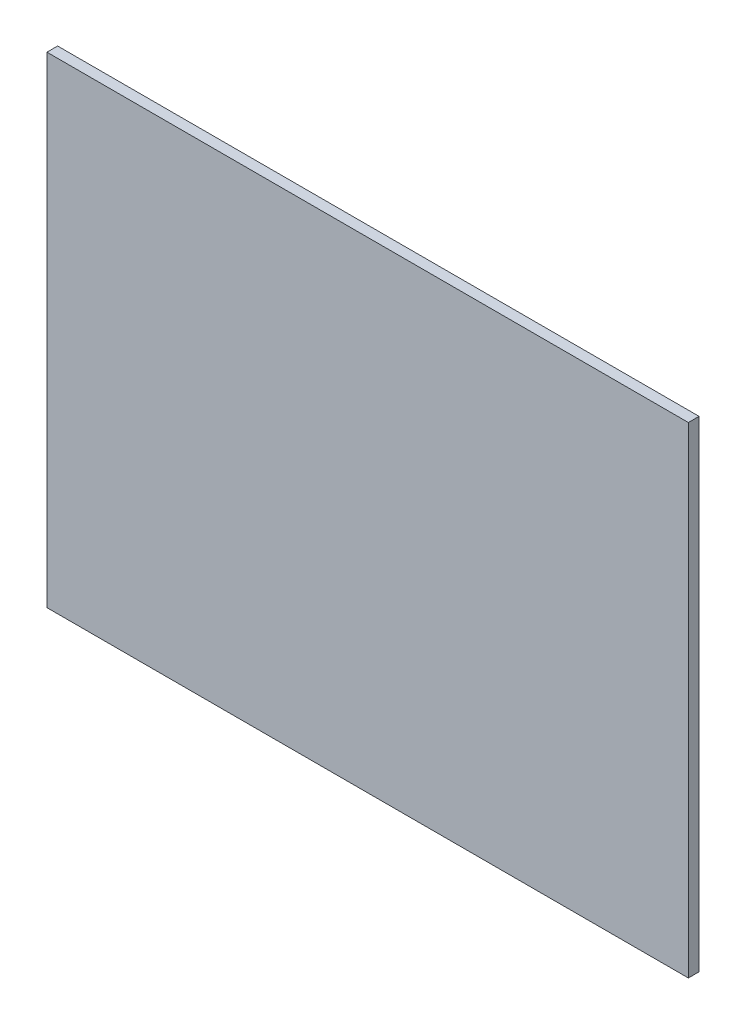
ISO-10303-21;
HEADER;
FILE_DESCRIPTION(('STEP AP214'),'2;1');
FILE_NAME('part.step','',(''),(''),'','','');
FILE_SCHEMA(('AUTOMOTIVE_DESIGN { 1 0 10303 214 1 1 1 1 }'));
ENDSEC;
DATA;
#1=APPLICATION_CONTEXT('core data for automotive mechanical design processes');
#2=APPLICATION_PROTOCOL_DEFINITION('international standard','automotive_design',2000,#1);
#3=PRODUCT_CONTEXT('',#1,'mechanical');
#4=PRODUCT('Part','Part','',(#3));
#5=PRODUCT_RELATED_PRODUCT_CATEGORY('part','',(#4));
#6=PRODUCT_DEFINITION_FORMATION('','',#4);
#7=PRODUCT_DEFINITION_CONTEXT('part definition',#1,'design');
#8=PRODUCT_DEFINITION('design','',#6,#7);
#9=PRODUCT_DEFINITION_SHAPE('','',#8);
#10=(LENGTH_UNIT() NAMED_UNIT(*) SI_UNIT(.MILLI.,.METRE.));
#11=(NAMED_UNIT(*) PLANE_ANGLE_UNIT() SI_UNIT($,.RADIAN.));
#12=(NAMED_UNIT(*) SI_UNIT($,.STERADIAN.) SOLID_ANGLE_UNIT());
#13=UNCERTAINTY_MEASURE_WITH_UNIT(LENGTH_MEASURE(1.E-05),#10,'distance_accuracy_value','');
#14=(GEOMETRIC_REPRESENTATION_CONTEXT(3) GLOBAL_UNCERTAINTY_ASSIGNED_CONTEXT((#13)) GLOBAL_UNIT_ASSIGNED_CONTEXT((#10,
#11,#12)) REPRESENTATION_CONTEXT('',''));
#15=CARTESIAN_POINT('',(0.,0.,0.));
#16=DIRECTION('',(0.,0.,1.));
#17=DIRECTION('',(1.,0.,0.));
#18=AXIS2_PLACEMENT_3D('',#15,#16,#17);
#19=CARTESIAN_POINT('',(-25.8167330677291,24.203187250996,1.));
#20=DIRECTION('',(1.,0.,0.));
#21=DIRECTION('',(0.,1.,0.));
#22=AXIS2_PLACEMENT_3D('',#19,#20,#21);
#23=PLANE('',#22);
#24=DIRECTION('',(0.,-1.,0.));
#25=VECTOR('',#24,1.);
#26=CARTESIAN_POINT('',(-25.8167330677291,24.203187250996,0.));
#27=LINE('',#26,#25);
#28=CARTESIAN_POINT('',(-25.8167330677291,24.203187250996,0.));
#29=VERTEX_POINT('',#28);
#30=CARTESIAN_POINT('',(-25.8167330677291,-20.796812749004,0.));
#31=VERTEX_POINT('',#30);
#32=EDGE_CURVE('E101',#29,#31,#27,.T.);
#33=ORIENTED_EDGE('',*,*,#32,.T.);
#34=DIRECTION('',(0.,0.,-1.));
#35=VECTOR('',#34,1.);
#36=CARTESIAN_POINT('',(-25.8167330677291,-20.796812749004,1.));
#37=LINE('',#36,#35);
#38=CARTESIAN_POINT('',(-25.8167330677291,-20.796812749004,1.));
#39=VERTEX_POINT('',#38);
#40=EDGE_CURVE('E11',#39,#31,#37,.T.);
#41=ORIENTED_EDGE('',*,*,#40,.F.);
#42=DIRECTION('',(0.,-1.,0.));
#43=VECTOR('',#42,1.);
#44=CARTESIAN_POINT('',(-25.8167330677291,24.203187250996,1.));
#45=LINE('',#44,#43);
#46=CARTESIAN_POINT('',(-25.8167330677291,24.203187250996,1.));
#47=VERTEX_POINT('',#46);
#48=EDGE_CURVE('E89',#47,#39,#45,.T.);
#49=ORIENTED_EDGE('',*,*,#48,.F.);
#50=DIRECTION('',(0.,0.,-1.));
#51=VECTOR('',#50,1.);
#52=CARTESIAN_POINT('',(-25.8167330677291,24.203187250996,1.));
#53=LINE('',#52,#51);
#54=EDGE_CURVE('E97',#47,#29,#53,.T.);
#55=ORIENTED_EDGE('',*,*,#54,.T.);
#56=EDGE_LOOP('',(#33,#41,#49,#55));
#57=FACE_BOUND('',#56,.T.);
#58=ADVANCED_FACE('F38',(#57),#23,.F.);
#59=CARTESIAN_POINT('',(-25.8167330677291,-20.796812749004,1.));
#60=DIRECTION('',(0.,1.,0.));
#61=DIRECTION('',(0.,0.,1.));
#62=AXIS2_PLACEMENT_3D('',#59,#60,#61);
#63=PLANE('',#62);
#64=DIRECTION('',(1.,0.,0.));
#65=VECTOR('',#64,1.);
#66=CARTESIAN_POINT('',(-25.8167330677291,-20.796812749004,0.));
#67=LINE('',#66,#65);
#68=CARTESIAN_POINT('',(34.1832669322709,-20.796812749004,0.));
#69=VERTEX_POINT('',#68);
#70=EDGE_CURVE('E93',#31,#69,#67,.T.);
#71=ORIENTED_EDGE('',*,*,#70,.T.);
#72=DIRECTION('',(0.,0.,-1.));
#73=VECTOR('',#72,1.);
#74=CARTESIAN_POINT('',(34.1832669322709,-20.796812749004,1.));
#75=LINE('',#74,#73);
#76=CARTESIAN_POINT('',(34.1832669322709,-20.796812749004,1.));
#77=VERTEX_POINT('',#76);
#78=EDGE_CURVE('E46',#77,#69,#75,.T.);
#79=ORIENTED_EDGE('',*,*,#78,.F.);
#80=DIRECTION('',(1.,0.,0.));
#81=VECTOR('',#80,1.);
#82=CARTESIAN_POINT('',(-25.8167330677291,-20.796812749004,1.));
#83=LINE('',#82,#81);
#84=EDGE_CURVE('E84',#39,#77,#83,.T.);
#85=ORIENTED_EDGE('',*,*,#84,.F.);
#86=ORIENTED_EDGE('',*,*,#40,.T.);
#87=EDGE_LOOP('',(#71,#79,#85,#86));
#88=FACE_BOUND('',#87,.T.);
#89=ADVANCED_FACE('F92',(#88),#63,.F.);
#90=CARTESIAN_POINT('',(34.1832669322709,24.203187250996,1.));
#91=DIRECTION('',(-1.,0.,0.));
#92=DIRECTION('',(0.,-1.,0.));
#93=AXIS2_PLACEMENT_3D('',#90,#91,#92);
#94=PLANE('',#93);
#95=DIRECTION('',(0.,1.,0.));
#96=VECTOR('',#95,1.);
#97=CARTESIAN_POINT('',(34.1832669322709,24.203187250996,0.));
#98=LINE('',#97,#96);
#99=CARTESIAN_POINT('',(34.1832669322709,24.203187250996,0.));
#100=VERTEX_POINT('',#99);
#101=EDGE_CURVE('E71',#69,#100,#98,.T.);
#102=ORIENTED_EDGE('',*,*,#101,.T.);
#103=DIRECTION('',(0.,0.,-1.));
#104=VECTOR('',#103,1.);
#105=CARTESIAN_POINT('',(34.1832669322709,24.203187250996,1.));
#106=LINE('',#105,#104);
#107=CARTESIAN_POINT('',(34.1832669322709,24.203187250996,1.));
#108=VERTEX_POINT('',#107);
#109=EDGE_CURVE('E94',#108,#100,#106,.T.);
#110=ORIENTED_EDGE('',*,*,#109,.F.);
#111=DIRECTION('',(0.,1.,0.));
#112=VECTOR('',#111,1.);
#113=CARTESIAN_POINT('',(34.1832669322709,24.203187250996,1.));
#114=LINE('',#113,#112);
#115=EDGE_CURVE('E87',#77,#108,#114,.T.);
#116=ORIENTED_EDGE('',*,*,#115,.F.);
#117=ORIENTED_EDGE('',*,*,#78,.T.);
#118=EDGE_LOOP('',(#102,#110,#116,#117));
#119=FACE_BOUND('',#118,.T.);
#120=ADVANCED_FACE('F95',(#119),#94,.F.);
#121=CARTESIAN_POINT('',(-25.8167330677291,24.203187250996,1.));
#122=DIRECTION('',(0.,-1.,0.));
#123=DIRECTION('',(0.,0.,-1.));
#124=AXIS2_PLACEMENT_3D('',#121,#122,#123);
#125=PLANE('',#124);
#126=DIRECTION('',(-1.,0.,0.));
#127=VECTOR('',#126,1.);
#128=CARTESIAN_POINT('',(-25.8167330677291,24.203187250996,0.));
#129=LINE('',#128,#127);
#130=EDGE_CURVE('E77',#100,#29,#129,.T.);
#131=ORIENTED_EDGE('',*,*,#130,.T.);
#132=ORIENTED_EDGE('',*,*,#54,.F.);
#133=DIRECTION('',(-1.,0.,0.));
#134=VECTOR('',#133,1.);
#135=CARTESIAN_POINT('',(-25.8167330677291,24.203187250996,1.));
#136=LINE('',#135,#134);
#137=EDGE_CURVE('E54',#108,#47,#136,.T.);
#138=ORIENTED_EDGE('',*,*,#137,.F.);
#139=ORIENTED_EDGE('',*,*,#109,.T.);
#140=EDGE_LOOP('',(#131,#132,#138,#139));
#141=FACE_BOUND('',#140,.T.);
#142=ADVANCED_FACE('F108',(#141),#125,.F.);
#143=CARTESIAN_POINT('',(0.,0.,1.));
#144=DIRECTION('',(0.,0.,1.));
#145=DIRECTION('',(1.,0.,0.));
#146=AXIS2_PLACEMENT_3D('',#143,#144,#145);
#147=PLANE('',#146);
#148=ORIENTED_EDGE('',*,*,#48,.T.);
#149=ORIENTED_EDGE('',*,*,#84,.T.);
#150=ORIENTED_EDGE('',*,*,#115,.T.);
#151=ORIENTED_EDGE('',*,*,#137,.T.);
#152=EDGE_LOOP('',(#148,#149,#150,#151));
#153=FACE_BOUND('',#152,.T.);
#154=ADVANCED_FACE('F85',(#153),#147,.T.);
#155=CARTESIAN_POINT('',(0.,0.,0.));
#156=DIRECTION('',(0.,0.,1.));
#157=DIRECTION('',(1.,0.,0.));
#158=AXIS2_PLACEMENT_3D('',#155,#156,#157);
#159=PLANE('',#158);
#160=ORIENTED_EDGE('',*,*,#32,.F.);
#161=ORIENTED_EDGE('',*,*,#130,.F.);
#162=ORIENTED_EDGE('',*,*,#101,.F.);
#163=ORIENTED_EDGE('',*,*,#70,.F.);
#164=EDGE_LOOP('',(#160,#161,#162,#163));
#165=FACE_BOUND('',#164,.T.);
#166=ADVANCED_FACE('F111',(#165),#159,.F.);
#167=CLOSED_SHELL('',(#58,#89,#120,#142,#154,#166));
#168=MANIFOLD_SOLID_BREP('B2',#167);
#169=ADVANCED_BREP_SHAPE_REPRESENTATION('',(#18,#168),#14);
#170=SHAPE_DEFINITION_REPRESENTATION(#9,#169);
ENDSEC;
END-ISO-10303-21;
